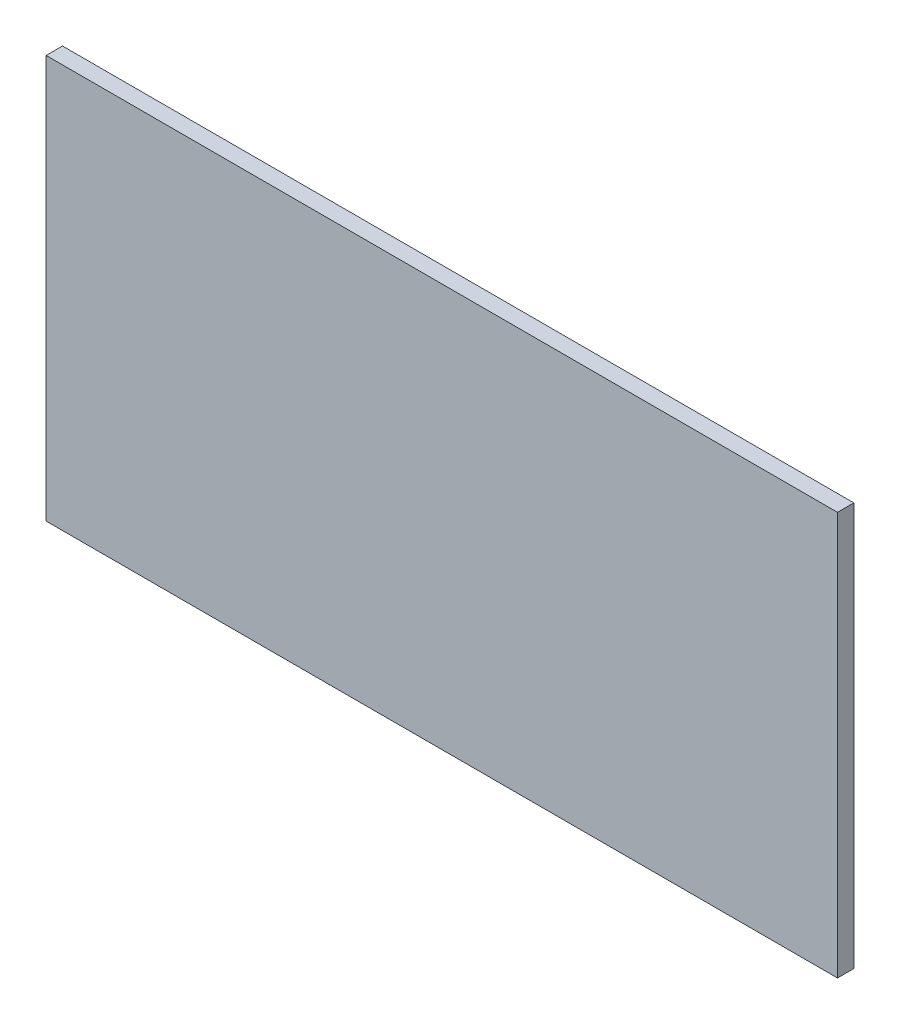
ISO-10303-21;
HEADER;
FILE_DESCRIPTION(('STEP AP214'),'2;1');
FILE_NAME('part.step','',(''),(''),'','','');
FILE_SCHEMA(('AUTOMOTIVE_DESIGN { 1 0 10303 214 1 1 1 1 }'));
ENDSEC;
DATA;
#1=APPLICATION_CONTEXT('core data for automotive mechanical design processes');
#2=APPLICATION_PROTOCOL_DEFINITION('international standard','automotive_design',2000,#1);
#3=PRODUCT_CONTEXT('',#1,'mechanical');
#4=PRODUCT('Part','Part','',(#3));
#5=PRODUCT_RELATED_PRODUCT_CATEGORY('part','',(#4));
#6=PRODUCT_DEFINITION_FORMATION('','',#4);
#7=PRODUCT_DEFINITION_CONTEXT('part definition',#1,'design');
#8=PRODUCT_DEFINITION('design','',#6,#7);
#9=PRODUCT_DEFINITION_SHAPE('','',#8);
#10=(LENGTH_UNIT() NAMED_UNIT(*) SI_UNIT(.MILLI.,.METRE.));
#11=(NAMED_UNIT(*) PLANE_ANGLE_UNIT() SI_UNIT($,.RADIAN.));
#12=(NAMED_UNIT(*) SI_UNIT($,.STERADIAN.) SOLID_ANGLE_UNIT());
#13=UNCERTAINTY_MEASURE_WITH_UNIT(LENGTH_MEASURE(1.E-05),#10,'distance_accuracy_value','');
#14=(GEOMETRIC_REPRESENTATION_CONTEXT(3) GLOBAL_UNCERTAINTY_ASSIGNED_CONTEXT((#13)) GLOBAL_UNIT_ASSIGNED_CONTEXT((#10,
#11,#12)) REPRESENTATION_CONTEXT('',''));
#15=CARTESIAN_POINT('',(0.,0.,0.));
#16=DIRECTION('',(0.,0.,1.));
#17=DIRECTION('',(1.,0.,0.));
#18=AXIS2_PLACEMENT_3D('',#15,#16,#17);
#19=CARTESIAN_POINT('',(-206.063387466682,77.0973181842051,11.90625));
#20=DIRECTION('',(1.,0.,0.));
#21=DIRECTION('',(0.,1.,0.));
#22=AXIS2_PLACEMENT_3D('',#19,#20,#21);
#23=PLANE('',#22);
#24=DIRECTION('',(0.,-1.,0.));
#25=VECTOR('',#24,1.);
#26=CARTESIAN_POINT('',(-206.063387466682,77.0973181842051,0.));
#27=LINE('',#26,#25);
#28=CARTESIAN_POINT('',(-206.063387466682,77.0973181842051,0.));
#29=VERTEX_POINT('',#28);
#30=CARTESIAN_POINT('',(-206.063387466682,-216.590181815795,0.));
#31=VERTEX_POINT('',#30);
#32=EDGE_CURVE('E95',#29,#31,#27,.T.);
#33=ORIENTED_EDGE('',*,*,#32,.T.);
#34=DIRECTION('',(0.,0.,-1.));
#35=VECTOR('',#34,1.);
#36=CARTESIAN_POINT('',(-206.063387466682,-216.590181815795,11.90625));
#37=LINE('',#36,#35);
#38=CARTESIAN_POINT('',(-206.063387466682,-216.590181815795,11.90625));
#39=VERTEX_POINT('',#38);
#40=EDGE_CURVE('E11',#39,#31,#37,.T.);
#41=ORIENTED_EDGE('',*,*,#40,.F.);
#42=DIRECTION('',(0.,-1.,0.));
#43=VECTOR('',#42,1.);
#44=CARTESIAN_POINT('',(-206.063387466682,77.0973181842051,11.90625));
#45=LINE('',#44,#43);
#46=CARTESIAN_POINT('',(-206.063387466682,77.0973181842051,11.90625));
#47=VERTEX_POINT('',#46);
#48=EDGE_CURVE('E83',#47,#39,#45,.T.);
#49=ORIENTED_EDGE('',*,*,#48,.F.);
#50=DIRECTION('',(0.,0.,-1.));
#51=VECTOR('',#50,1.);
#52=CARTESIAN_POINT('',(-206.063387466682,77.0973181842051,11.90625));
#53=LINE('',#52,#51);
#54=EDGE_CURVE('E91',#47,#29,#53,.T.);
#55=ORIENTED_EDGE('',*,*,#54,.T.);
#56=EDGE_LOOP('',(#33,#41,#49,#55));
#57=FACE_BOUND('',#56,.T.);
#58=ADVANCED_FACE('F32',(#57),#23,.F.);
#59=CARTESIAN_POINT('',(-206.063387466682,-216.590181815795,11.90625));
#60=DIRECTION('',(0.,1.,0.));
#61=DIRECTION('',(0.,0.,1.));
#62=AXIS2_PLACEMENT_3D('',#59,#60,#61);
#63=PLANE('',#62);
#64=DIRECTION('',(1.,0.,0.));
#65=VECTOR('',#64,1.);
#66=CARTESIAN_POINT('',(-206.063387466682,-216.590181815795,0.));
#67=LINE('',#66,#65);
#68=CARTESIAN_POINT('',(370.199112533318,-216.590181815795,0.));
#69=VERTEX_POINT('',#68);
#70=EDGE_CURVE('E87',#31,#69,#67,.T.);
#71=ORIENTED_EDGE('',*,*,#70,.T.);
#72=DIRECTION('',(0.,0.,-1.));
#73=VECTOR('',#72,1.);
#74=CARTESIAN_POINT('',(370.199112533318,-216.590181815795,11.90625));
#75=LINE('',#74,#73);
#76=CARTESIAN_POINT('',(370.199112533318,-216.590181815795,11.90625));
#77=VERTEX_POINT('',#76);
#78=EDGE_CURVE('E40',#77,#69,#75,.T.);
#79=ORIENTED_EDGE('',*,*,#78,.F.);
#80=DIRECTION('',(1.,0.,0.));
#81=VECTOR('',#80,1.);
#82=CARTESIAN_POINT('',(-206.063387466682,-216.590181815795,11.90625));
#83=LINE('',#82,#81);
#84=EDGE_CURVE('E78',#39,#77,#83,.T.);
#85=ORIENTED_EDGE('',*,*,#84,.F.);
#86=ORIENTED_EDGE('',*,*,#40,.T.);
#87=EDGE_LOOP('',(#71,#79,#85,#86));
#88=FACE_BOUND('',#87,.T.);
#89=ADVANCED_FACE('F86',(#88),#63,.F.);
#90=CARTESIAN_POINT('',(370.199112533318,77.0973181842051,11.90625));
#91=DIRECTION('',(-1.,0.,0.));
#92=DIRECTION('',(0.,0.,1.));
#93=AXIS2_PLACEMENT_3D('',#90,#91,#92);
#94=PLANE('',#93);
#95=DIRECTION('',(0.,1.,0.));
#96=VECTOR('',#95,1.);
#97=CARTESIAN_POINT('',(370.199112533318,77.0973181842051,0.));
#98=LINE('',#97,#96);
#99=CARTESIAN_POINT('',(370.199112533318,77.0973181842051,0.));
#100=VERTEX_POINT('',#99);
#101=EDGE_CURVE('E65',#69,#100,#98,.T.);
#102=ORIENTED_EDGE('',*,*,#101,.T.);
#103=DIRECTION('',(0.,0.,-1.));
#104=VECTOR('',#103,1.);
#105=CARTESIAN_POINT('',(370.199112533318,77.0973181842051,11.90625));
#106=LINE('',#105,#104);
#107=CARTESIAN_POINT('',(370.199112533318,77.0973181842051,11.90625));
#108=VERTEX_POINT('',#107);
#109=EDGE_CURVE('E88',#108,#100,#106,.T.);
#110=ORIENTED_EDGE('',*,*,#109,.F.);
#111=DIRECTION('',(0.,1.,0.));
#112=VECTOR('',#111,1.);
#113=CARTESIAN_POINT('',(370.199112533318,77.0973181842051,11.90625));
#114=LINE('',#113,#112);
#115=EDGE_CURVE('E81',#77,#108,#114,.T.);
#116=ORIENTED_EDGE('',*,*,#115,.F.);
#117=ORIENTED_EDGE('',*,*,#78,.T.);
#118=EDGE_LOOP('',(#102,#110,#116,#117));
#119=FACE_BOUND('',#118,.T.);
#120=ADVANCED_FACE('F89',(#119),#94,.F.);
#121=CARTESIAN_POINT('',(-206.063387466682,77.0973181842051,11.90625));
#122=DIRECTION('',(0.,-1.,0.));
#123=DIRECTION('',(0.,0.,-1.));
#124=AXIS2_PLACEMENT_3D('',#121,#122,#123);
#125=PLANE('',#124);
#126=DIRECTION('',(-1.,0.,0.));
#127=VECTOR('',#126,1.);
#128=CARTESIAN_POINT('',(-206.063387466682,77.0973181842051,0.));
#129=LINE('',#128,#127);
#130=EDGE_CURVE('E71',#100,#29,#129,.T.);
#131=ORIENTED_EDGE('',*,*,#130,.T.);
#132=ORIENTED_EDGE('',*,*,#54,.F.);
#133=DIRECTION('',(-1.,0.,0.));
#134=VECTOR('',#133,1.);
#135=CARTESIAN_POINT('',(-206.063387466682,77.0973181842051,11.90625));
#136=LINE('',#135,#134);
#137=EDGE_CURVE('E48',#108,#47,#136,.T.);
#138=ORIENTED_EDGE('',*,*,#137,.F.);
#139=ORIENTED_EDGE('',*,*,#109,.T.);
#140=EDGE_LOOP('',(#131,#132,#138,#139));
#141=FACE_BOUND('',#140,.T.);
#142=ADVANCED_FACE('F102',(#141),#125,.F.);
#143=CARTESIAN_POINT('',(0.,0.,11.90625));
#144=DIRECTION('',(0.,0.,1.));
#145=DIRECTION('',(1.,0.,0.));
#146=AXIS2_PLACEMENT_3D('',#143,#144,#145);
#147=PLANE('',#146);
#148=ORIENTED_EDGE('',*,*,#48,.T.);
#149=ORIENTED_EDGE('',*,*,#84,.T.);
#150=ORIENTED_EDGE('',*,*,#115,.T.);
#151=ORIENTED_EDGE('',*,*,#137,.T.);
#152=EDGE_LOOP('',(#148,#149,#150,#151));
#153=FACE_BOUND('',#152,.T.);
#154=ADVANCED_FACE('F79',(#153),#147,.T.);
#155=CARTESIAN_POINT('',(0.,0.,0.));
#156=DIRECTION('',(0.,0.,1.));
#157=DIRECTION('',(1.,0.,0.));
#158=AXIS2_PLACEMENT_3D('',#155,#156,#157);
#159=PLANE('',#158);
#160=ORIENTED_EDGE('',*,*,#32,.F.);
#161=ORIENTED_EDGE('',*,*,#130,.F.);
#162=ORIENTED_EDGE('',*,*,#101,.F.);
#163=ORIENTED_EDGE('',*,*,#70,.F.);
#164=EDGE_LOOP('',(#160,#161,#162,#163));
#165=FACE_BOUND('',#164,.T.);
#166=ADVANCED_FACE('F105',(#165),#159,.F.);
#167=CLOSED_SHELL('',(#58,#89,#120,#142,#154,#166));
#168=MANIFOLD_SOLID_BREP('B2',#167);
#169=ADVANCED_BREP_SHAPE_REPRESENTATION('',(#18,#168),#14);
#170=SHAPE_DEFINITION_REPRESENTATION(#9,#169);
ENDSEC;
END-ISO-10303-21;
